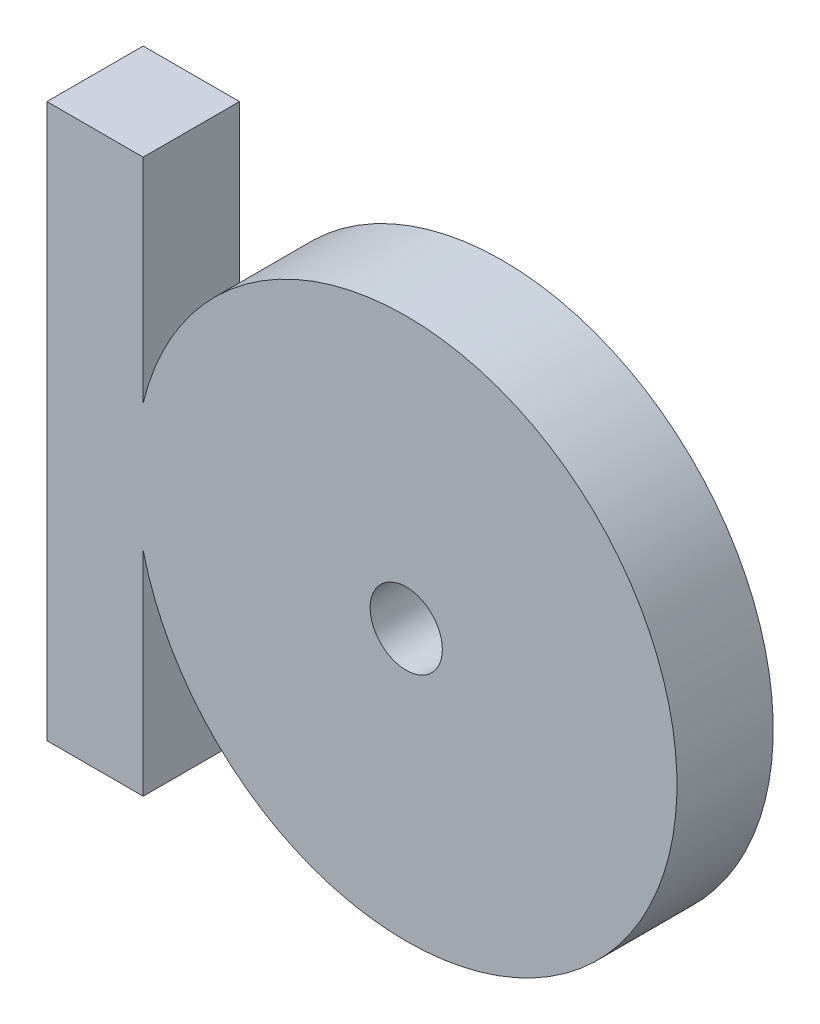
ISO-10303-21;
HEADER;
FILE_DESCRIPTION(('STEP AP214'),'2;1');
FILE_NAME('part.step','',(''),(''),'','','');
FILE_SCHEMA(('AUTOMOTIVE_DESIGN { 1 0 10303 214 1 1 1 1 }'));
ENDSEC;
DATA;
#1=APPLICATION_CONTEXT('core data for automotive mechanical design processes');
#2=APPLICATION_PROTOCOL_DEFINITION('international standard','automotive_design',2000,#1);
#3=PRODUCT_CONTEXT('',#1,'mechanical');
#4=PRODUCT('Part','Part','',(#3));
#5=PRODUCT_RELATED_PRODUCT_CATEGORY('part','',(#4));
#6=PRODUCT_DEFINITION_FORMATION('','',#4);
#7=PRODUCT_DEFINITION_CONTEXT('part definition',#1,'design');
#8=PRODUCT_DEFINITION('design','',#6,#7);
#9=PRODUCT_DEFINITION_SHAPE('','',#8);
#10=(LENGTH_UNIT() NAMED_UNIT(*) SI_UNIT(.MILLI.,.METRE.));
#11=(NAMED_UNIT(*) PLANE_ANGLE_UNIT() SI_UNIT($,.RADIAN.));
#12=(NAMED_UNIT(*) SI_UNIT($,.STERADIAN.) SOLID_ANGLE_UNIT());
#13=UNCERTAINTY_MEASURE_WITH_UNIT(LENGTH_MEASURE(1.E-05),#10,'distance_accuracy_value','');
#14=(GEOMETRIC_REPRESENTATION_CONTEXT(3) GLOBAL_UNCERTAINTY_ASSIGNED_CONTEXT((#13)) GLOBAL_UNIT_ASSIGNED_CONTEXT((#10,
#11,#12)) REPRESENTATION_CONTEXT('',''));
#15=CARTESIAN_POINT('',(0.,0.,0.));
#16=DIRECTION('',(0.,0.,1.));
#17=DIRECTION('',(1.,0.,0.));
#18=AXIS2_PLACEMENT_3D('',#15,#16,#17);
#19=CARTESIAN_POINT('',(14.9313765366664,11.5,4.));
#20=DIRECTION('',(0.,0.,1.));
#21=DIRECTION('',(1.,0.,0.));
#22=AXIS2_PLACEMENT_3D('',#19,#20,#21);
#23=PLANE('',#22);
#24=DIRECTION('',(0.,-1.,0.));
#25=VECTOR('',#24,1.);
#26=CARTESIAN_POINT('',(0.,0.,4.));
#27=LINE('',#26,#25);
#28=CARTESIAN_POINT('',(0.,23.,4.));
#29=VERTEX_POINT('',#28);
#30=CARTESIAN_POINT('',(0.,0.,4.));
#31=VERTEX_POINT('',#30);
#32=EDGE_CURVE('E144',#29,#31,#27,.T.);
#33=ORIENTED_EDGE('',*,*,#32,.T.);
#34=DIRECTION('',(1.,0.,0.));
#35=VECTOR('',#34,1.);
#36=CARTESIAN_POINT('',(0.,0.,4.));
#37=LINE('',#36,#35);
#38=CARTESIAN_POINT('',(4.,0.,4.));
#39=VERTEX_POINT('',#38);
#40=EDGE_CURVE('E95',#31,#39,#37,.T.);
#41=ORIENTED_EDGE('',*,*,#40,.T.);
#42=DIRECTION('',(0.,1.,0.));
#43=VECTOR('',#42,1.);
#44=CARTESIAN_POINT('',(4.,0.,4.));
#45=LINE('',#44,#43);
#46=CARTESIAN_POINT('',(4.,8.84152167328399,4.));
#47=VERTEX_POINT('',#46);
#48=EDGE_CURVE('E108',#39,#47,#45,.T.);
#49=ORIENTED_EDGE('',*,*,#48,.T.);
#50=CARTESIAN_POINT('',(14.9313765366664,11.5,4.));
#51=DIRECTION('',(0.,0.,1.));
#52=DIRECTION('',(1.,0.,0.));
#53=AXIS2_PLACEMENT_3D('',#50,#51,#52);
#54=CIRCLE('',#53,11.25);
#55=CARTESIAN_POINT('',(4.,14.158478326716,4.));
#56=VERTEX_POINT('',#55);
#57=EDGE_CURVE('E102',#47,#56,#54,.T.);
#58=ORIENTED_EDGE('',*,*,#57,.T.);
#59=DIRECTION('',(0.,1.,0.));
#60=VECTOR('',#59,1.);
#61=CARTESIAN_POINT('',(4.,14.158478326716,4.));
#62=LINE('',#61,#60);
#63=CARTESIAN_POINT('',(4.,23.,4.));
#64=VERTEX_POINT('',#63);
#65=EDGE_CURVE('E106',#56,#64,#62,.T.);
#66=ORIENTED_EDGE('',*,*,#65,.T.);
#67=DIRECTION('',(-1.,0.,0.));
#68=VECTOR('',#67,1.);
#69=CARTESIAN_POINT('',(0.,23.,4.));
#70=LINE('',#69,#68);
#71=EDGE_CURVE('E58',#64,#29,#70,.T.);
#72=ORIENTED_EDGE('',*,*,#71,.T.);
#73=EDGE_LOOP('',(#33,#41,#49,#58,#66,#72));
#74=FACE_BOUND('',#73,.T.);
#75=CARTESIAN_POINT('',(14.9313765366664,11.5,4.));
#76=DIRECTION('',(0.,0.,1.));
#77=DIRECTION('',(1.,0.,0.));
#78=AXIS2_PLACEMENT_3D('',#75,#76,#77);
#79=CIRCLE('',#78,1.5);
#80=CARTESIAN_POINT('',(16.4313765366664,11.5,4.));
#81=VERTEX_POINT('',#80);
#82=EDGE_CURVE('E151',#81,#81,#79,.T.);
#83=ORIENTED_EDGE('',*,*,#82,.F.);
#84=EDGE_LOOP('',(#83));
#85=FACE_BOUND('',#84,.T.);
#86=ADVANCED_FACE('F40',(#74,#85),#23,.T.);
#87=CARTESIAN_POINT('',(14.9313765366664,11.5,0.));
#88=DIRECTION('',(0.,0.,1.));
#89=DIRECTION('',(1.,0.,0.));
#90=AXIS2_PLACEMENT_3D('',#87,#88,#89);
#91=PLANE('',#90);
#92=DIRECTION('',(0.,-1.,0.));
#93=VECTOR('',#92,1.);
#94=CARTESIAN_POINT('',(0.,0.,0.));
#95=LINE('',#94,#93);
#96=CARTESIAN_POINT('',(0.,23.,0.));
#97=VERTEX_POINT('',#96);
#98=CARTESIAN_POINT('',(0.,0.,0.));
#99=VERTEX_POINT('',#98);
#100=EDGE_CURVE('E155',#97,#99,#95,.T.);
#101=ORIENTED_EDGE('',*,*,#100,.F.);
#102=DIRECTION('',(-1.,0.,0.));
#103=VECTOR('',#102,1.);
#104=CARTESIAN_POINT('',(0.,23.,0.));
#105=LINE('',#104,#103);
#106=CARTESIAN_POINT('',(4.,23.,0.));
#107=VERTEX_POINT('',#106);
#108=EDGE_CURVE('E87',#107,#97,#105,.T.);
#109=ORIENTED_EDGE('',*,*,#108,.F.);
#110=DIRECTION('',(0.,1.,0.));
#111=VECTOR('',#110,1.);
#112=CARTESIAN_POINT('',(4.,14.158478326716,0.));
#113=LINE('',#112,#111);
#114=CARTESIAN_POINT('',(4.,14.158478326716,0.));
#115=VERTEX_POINT('',#114);
#116=EDGE_CURVE('E81',#115,#107,#113,.T.);
#117=ORIENTED_EDGE('',*,*,#116,.F.);
#118=CARTESIAN_POINT('',(14.9313765366664,11.5,0.));
#119=DIRECTION('',(0.,0.,1.));
#120=DIRECTION('',(1.,0.,0.));
#121=AXIS2_PLACEMENT_3D('',#118,#119,#120);
#122=CIRCLE('',#121,11.25);
#123=CARTESIAN_POINT('',(4.,8.84152167328399,0.));
#124=VERTEX_POINT('',#123);
#125=EDGE_CURVE('E117',#124,#115,#122,.T.);
#126=ORIENTED_EDGE('',*,*,#125,.F.);
#127=DIRECTION('',(0.,1.,0.));
#128=VECTOR('',#127,1.);
#129=CARTESIAN_POINT('',(4.,0.,0.));
#130=LINE('',#129,#128);
#131=CARTESIAN_POINT('',(4.,0.,0.));
#132=VERTEX_POINT('',#131);
#133=EDGE_CURVE('E165',#132,#124,#130,.T.);
#134=ORIENTED_EDGE('',*,*,#133,.F.);
#135=DIRECTION('',(1.,0.,0.));
#136=VECTOR('',#135,1.);
#137=CARTESIAN_POINT('',(0.,0.,0.));
#138=LINE('',#137,#136);
#139=EDGE_CURVE('E160',#99,#132,#138,.T.);
#140=ORIENTED_EDGE('',*,*,#139,.F.);
#141=EDGE_LOOP('',(#101,#109,#117,#126,#134,#140));
#142=FACE_BOUND('',#141,.T.);
#143=CARTESIAN_POINT('',(14.9313765366664,11.5,0.));
#144=DIRECTION('',(0.,0.,1.));
#145=DIRECTION('',(1.,0.,0.));
#146=AXIS2_PLACEMENT_3D('',#143,#144,#145);
#147=CIRCLE('',#146,1.5);
#148=CARTESIAN_POINT('',(16.4313765366664,11.5,0.));
#149=VERTEX_POINT('',#148);
#150=EDGE_CURVE('E148',#149,#149,#147,.T.);
#151=ORIENTED_EDGE('',*,*,#150,.T.);
#152=EDGE_LOOP('',(#151));
#153=FACE_BOUND('',#152,.T.);
#154=ADVANCED_FACE('F187',(#142,#153),#91,.F.);
#155=CARTESIAN_POINT('',(0.,0.,4.));
#156=DIRECTION('',(1.,0.,0.));
#157=DIRECTION('',(0.,0.,-1.));
#158=AXIS2_PLACEMENT_3D('',#155,#156,#157);
#159=PLANE('',#158);
#160=ORIENTED_EDGE('',*,*,#100,.T.);
#161=DIRECTION('',(0.,0.,-1.));
#162=VECTOR('',#161,1.);
#163=CARTESIAN_POINT('',(0.,0.,4.));
#164=LINE('',#163,#162);
#165=EDGE_CURVE('E12',#31,#99,#164,.T.);
#166=ORIENTED_EDGE('',*,*,#165,.F.);
#167=ORIENTED_EDGE('',*,*,#32,.F.);
#168=DIRECTION('',(0.,0.,-1.));
#169=VECTOR('',#168,1.);
#170=CARTESIAN_POINT('',(0.,23.,4.));
#171=LINE('',#170,#169);
#172=EDGE_CURVE('E126',#29,#97,#171,.T.);
#173=ORIENTED_EDGE('',*,*,#172,.T.);
#174=EDGE_LOOP('',(#160,#166,#167,#173));
#175=FACE_BOUND('',#174,.T.);
#176=ADVANCED_FACE('F42',(#175),#159,.F.);
#177=CARTESIAN_POINT('',(0.,0.,4.));
#178=DIRECTION('',(0.,1.,0.));
#179=DIRECTION('',(0.,0.,1.));
#180=AXIS2_PLACEMENT_3D('',#177,#178,#179);
#181=PLANE('',#180);
#182=ORIENTED_EDGE('',*,*,#139,.T.);
#183=DIRECTION('',(0.,0.,-1.));
#184=VECTOR('',#183,1.);
#185=CARTESIAN_POINT('',(4.,0.,4.));
#186=LINE('',#185,#184);
#187=EDGE_CURVE('E50',#39,#132,#186,.T.);
#188=ORIENTED_EDGE('',*,*,#187,.F.);
#189=ORIENTED_EDGE('',*,*,#40,.F.);
#190=ORIENTED_EDGE('',*,*,#165,.T.);
#191=EDGE_LOOP('',(#182,#188,#189,#190));
#192=FACE_BOUND('',#191,.T.);
#193=ADVANCED_FACE('F189',(#192),#181,.F.);
#194=CARTESIAN_POINT('',(4.,0.,4.));
#195=DIRECTION('',(-1.,0.,0.));
#196=DIRECTION('',(0.,0.,1.));
#197=AXIS2_PLACEMENT_3D('',#194,#195,#196);
#198=PLANE('',#197);
#199=ORIENTED_EDGE('',*,*,#133,.T.);
#200=DIRECTION('',(0.,0.,-1.));
#201=VECTOR('',#200,1.);
#202=CARTESIAN_POINT('',(4.,8.84152167328399,4.));
#203=LINE('',#202,#201);
#204=EDGE_CURVE('E119',#47,#124,#203,.T.);
#205=ORIENTED_EDGE('',*,*,#204,.F.);
#206=ORIENTED_EDGE('',*,*,#48,.F.);
#207=ORIENTED_EDGE('',*,*,#187,.T.);
#208=EDGE_LOOP('',(#199,#205,#206,#207));
#209=FACE_BOUND('',#208,.T.);
#210=ADVANCED_FACE('F185',(#209),#198,.F.);
#211=CARTESIAN_POINT('',(14.9313765366664,11.5,4.));
#212=DIRECTION('',(0.,0.,-1.));
#213=DIRECTION('',(-1.,0.,0.));
#214=AXIS2_PLACEMENT_3D('',#211,#212,#213);
#215=CYLINDRICAL_SURFACE('',#214,11.25);
#216=ORIENTED_EDGE('',*,*,#125,.T.);
#217=DIRECTION('',(0.,0.,-1.));
#218=VECTOR('',#217,1.);
#219=CARTESIAN_POINT('',(4.,14.158478326716,4.));
#220=LINE('',#219,#218);
#221=EDGE_CURVE('E114',#56,#115,#220,.T.);
#222=ORIENTED_EDGE('',*,*,#221,.F.);
#223=ORIENTED_EDGE('',*,*,#57,.F.);
#224=ORIENTED_EDGE('',*,*,#204,.T.);
#225=EDGE_LOOP('',(#216,#222,#223,#224));
#226=FACE_BOUND('',#225,.T.);
#227=ADVANCED_FACE('F115',(#226),#215,.T.);
#228=CARTESIAN_POINT('',(4.,14.158478326716,4.));
#229=DIRECTION('',(-1.,0.,0.));
#230=DIRECTION('',(0.,0.,1.));
#231=AXIS2_PLACEMENT_3D('',#228,#229,#230);
#232=PLANE('',#231);
#233=ORIENTED_EDGE('',*,*,#116,.T.);
#234=DIRECTION('',(0.,0.,-1.));
#235=VECTOR('',#234,1.);
#236=CARTESIAN_POINT('',(4.,23.,4.));
#237=LINE('',#236,#235);
#238=EDGE_CURVE('E120',#64,#107,#237,.T.);
#239=ORIENTED_EDGE('',*,*,#238,.F.);
#240=ORIENTED_EDGE('',*,*,#65,.F.);
#241=ORIENTED_EDGE('',*,*,#221,.T.);
#242=EDGE_LOOP('',(#233,#239,#240,#241));
#243=FACE_BOUND('',#242,.T.);
#244=ADVANCED_FACE('F122',(#243),#232,.F.);
#245=CARTESIAN_POINT('',(0.,23.,4.));
#246=DIRECTION('',(0.,-1.,0.));
#247=DIRECTION('',(0.,0.,-1.));
#248=AXIS2_PLACEMENT_3D('',#245,#246,#247);
#249=PLANE('',#248);
#250=ORIENTED_EDGE('',*,*,#108,.T.);
#251=ORIENTED_EDGE('',*,*,#172,.F.);
#252=ORIENTED_EDGE('',*,*,#71,.F.);
#253=ORIENTED_EDGE('',*,*,#238,.T.);
#254=EDGE_LOOP('',(#250,#251,#252,#253));
#255=FACE_BOUND('',#254,.T.);
#256=ADVANCED_FACE('F191',(#255),#249,.F.);
#257=CARTESIAN_POINT('',(14.9313765366664,11.5,4.));
#258=DIRECTION('',(0.,0.,-1.));
#259=DIRECTION('',(-1.,0.,0.));
#260=AXIS2_PLACEMENT_3D('',#257,#258,#259);
#261=CYLINDRICAL_SURFACE('',#260,1.5);
#262=ORIENTED_EDGE('',*,*,#82,.T.);
#263=EDGE_LOOP('',(#262));
#264=FACE_BOUND('',#263,.T.);
#265=ORIENTED_EDGE('',*,*,#150,.F.);
#266=EDGE_LOOP('',(#265));
#267=FACE_BOUND('',#266,.T.);
#268=ADVANCED_FACE('F193',(#264,#267),#261,.F.);
#269=CLOSED_SHELL('',(#86,#154,#176,#193,#210,#227,#244,#256,#268));
#270=MANIFOLD_SOLID_BREP('B2',#269);
#271=ADVANCED_BREP_SHAPE_REPRESENTATION('',(#18,#270),#14);
#272=SHAPE_DEFINITION_REPRESENTATION(#9,#271);
ENDSEC;
END-ISO-10303-21;
